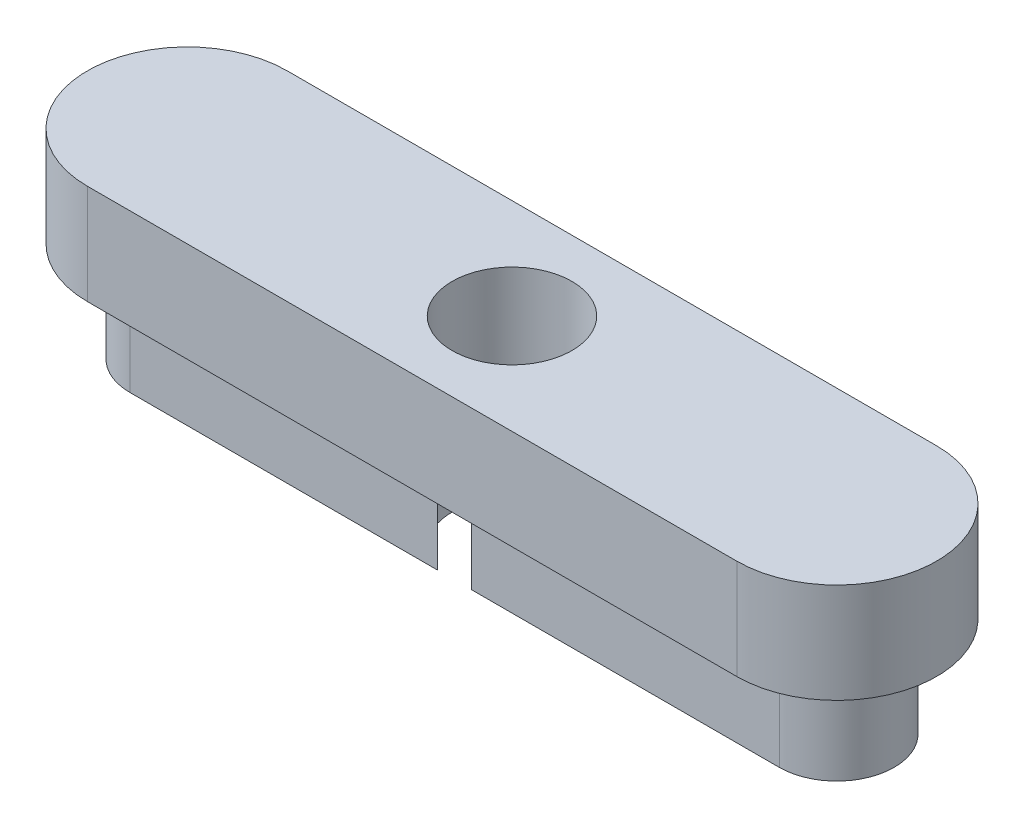
ISO-10303-21;
HEADER;
FILE_DESCRIPTION(('STEP AP214'),'2;1');
FILE_NAME('part.step','',(''),(''),'','','');
FILE_SCHEMA(('AUTOMOTIVE_DESIGN { 1 0 10303 214 1 1 1 1 }'));
ENDSEC;
DATA;
#1=APPLICATION_CONTEXT('core data for automotive mechanical design processes');
#2=APPLICATION_PROTOCOL_DEFINITION('international standard','automotive_design',2000,#1);
#3=PRODUCT_CONTEXT('',#1,'mechanical');
#4=PRODUCT('Part','Part','',(#3));
#5=PRODUCT_RELATED_PRODUCT_CATEGORY('part','',(#4));
#6=PRODUCT_DEFINITION_FORMATION('','',#4);
#7=PRODUCT_DEFINITION_CONTEXT('part definition',#1,'design');
#8=PRODUCT_DEFINITION('design','',#6,#7);
#9=PRODUCT_DEFINITION_SHAPE('','',#8);
#10=(LENGTH_UNIT() NAMED_UNIT(*) SI_UNIT(.MILLI.,.METRE.));
#11=(NAMED_UNIT(*) PLANE_ANGLE_UNIT() SI_UNIT($,.RADIAN.));
#12=(NAMED_UNIT(*) SI_UNIT($,.STERADIAN.) SOLID_ANGLE_UNIT());
#13=UNCERTAINTY_MEASURE_WITH_UNIT(LENGTH_MEASURE(1.E-05),#10,'distance_accuracy_value','');
#14=(GEOMETRIC_REPRESENTATION_CONTEXT(3) GLOBAL_UNCERTAINTY_ASSIGNED_CONTEXT((#13)) GLOBAL_UNIT_ASSIGNED_CONTEXT((#10,
#11,#12)) REPRESENTATION_CONTEXT('',''));
#15=CARTESIAN_POINT('',(0.,0.,0.));
#16=DIRECTION('',(0.,0.,1.));
#17=DIRECTION('',(1.,0.,0.));
#18=AXIS2_PLACEMENT_3D('',#15,#16,#17);
#19=CARTESIAN_POINT('',(-6.5,-2.,-1.15000000000001));
#20=DIRECTION('',(0.,0.,1.));
#21=DIRECTION('',(1.,0.,0.));
#22=AXIS2_PLACEMENT_3D('',#19,#20,#21);
#23=PLANE('',#22);
#24=DIRECTION('',(1.,0.,0.));
#25=VECTOR('',#24,1.);
#26=CARTESIAN_POINT('',(-6.5,0.,-1.15000000000001));
#27=LINE('',#26,#25);
#28=CARTESIAN_POINT('',(-6.5,0.,-1.15000000000001));
#29=VERTEX_POINT('',#28);
#30=CARTESIAN_POINT('',(-0.342782730020034,0.,-1.15000000000001));
#31=VERTEX_POINT('',#30);
#32=EDGE_CURVE('E183',#29,#31,#27,.T.);
#33=ORIENTED_EDGE('',*,*,#32,.T.);
#34=DIRECTION('',(0.,-1.,0.));
#35=VECTOR('',#34,1.);
#36=CARTESIAN_POINT('',(-0.342782730020034,2.,-1.15000000000001));
#37=LINE('',#36,#35);
#38=CARTESIAN_POINT('',(-0.342782730020034,-2.,-1.15000000000001));
#39=VERTEX_POINT('',#38);
#40=EDGE_CURVE('E182',#31,#39,#37,.T.);
#41=ORIENTED_EDGE('',*,*,#40,.T.);
#42=DIRECTION('',(1.,0.,0.));
#43=VECTOR('',#42,1.);
#44=CARTESIAN_POINT('',(-6.5,-2.,-1.15000000000001));
#45=LINE('',#44,#43);
#46=CARTESIAN_POINT('',(-6.5,-2.,-1.15000000000001));
#47=VERTEX_POINT('',#46);
#48=EDGE_CURVE('E159',#47,#39,#45,.T.);
#49=ORIENTED_EDGE('',*,*,#48,.F.);
#50=DIRECTION('',(0.,1.,0.));
#51=VECTOR('',#50,1.);
#52=CARTESIAN_POINT('',(-6.5,-2.,-1.15000000000001));
#53=LINE('',#52,#51);
#54=EDGE_CURVE('E203',#47,#29,#53,.T.);
#55=ORIENTED_EDGE('',*,*,#54,.T.);
#56=EDGE_LOOP('',(#33,#41,#49,#55));
#57=FACE_BOUND('',#56,.T.);
#58=ADVANCED_FACE('F43',(#57),#23,.F.);
#59=CARTESIAN_POINT('',(-6.5,-2.,1.15000000000001));
#60=DIRECTION('',(0.,0.,-1.));
#61=DIRECTION('',(-1.,0.,0.));
#62=AXIS2_PLACEMENT_3D('',#59,#60,#61);
#63=PLANE('',#62);
#64=DIRECTION('',(-1.,0.,0.));
#65=VECTOR('',#64,1.);
#66=CARTESIAN_POINT('',(-6.5,0.,1.15000000000001));
#67=LINE('',#66,#65);
#68=CARTESIAN_POINT('',(6.5,0.,1.15000000000001));
#69=VERTEX_POINT('',#68);
#70=CARTESIAN_POINT('',(0.342782730020026,0.,1.15000000000001));
#71=VERTEX_POINT('',#70);
#72=EDGE_CURVE('E167',#69,#71,#67,.T.);
#73=ORIENTED_EDGE('',*,*,#72,.T.);
#74=DIRECTION('',(0.,-1.,0.));
#75=VECTOR('',#74,1.);
#76=CARTESIAN_POINT('',(0.342782730020025,2.,1.15000000000001));
#77=LINE('',#76,#75);
#78=CARTESIAN_POINT('',(0.342782730020026,-2.,1.15000000000001));
#79=VERTEX_POINT('',#78);
#80=EDGE_CURVE('E142',#71,#79,#77,.T.);
#81=ORIENTED_EDGE('',*,*,#80,.T.);
#82=DIRECTION('',(-1.,0.,0.));
#83=VECTOR('',#82,1.);
#84=CARTESIAN_POINT('',(-6.5,-2.,1.15000000000001));
#85=LINE('',#84,#83);
#86=CARTESIAN_POINT('',(6.5,-2.,1.15000000000001));
#87=VERTEX_POINT('',#86);
#88=EDGE_CURVE('E150',#87,#79,#85,.T.);
#89=ORIENTED_EDGE('',*,*,#88,.F.);
#90=DIRECTION('',(0.,1.,0.));
#91=VECTOR('',#90,1.);
#92=CARTESIAN_POINT('',(6.5,-2.,1.15000000000001));
#93=LINE('',#92,#91);
#94=EDGE_CURVE('E197',#87,#69,#93,.T.);
#95=ORIENTED_EDGE('',*,*,#94,.T.);
#96=EDGE_LOOP('',(#73,#81,#89,#95));
#97=FACE_BOUND('',#96,.T.);
#98=ADVANCED_FACE('F284',(#97),#63,.F.);
#99=CARTESIAN_POINT('',(-6.5,-2.,0.));
#100=DIRECTION('',(0.,-1.,0.));
#101=DIRECTION('',(0.,0.,-1.));
#102=AXIS2_PLACEMENT_3D('',#99,#100,#101);
#103=PLANE('',#102);
#104=CARTESIAN_POINT('',(0.,-2.,0.));
#105=DIRECTION('',(0.,-1.,0.));
#106=DIRECTION('',(0.,0.,-1.));
#107=AXIS2_PLACEMENT_3D('',#104,#105,#106);
#108=CIRCLE('',#107,1.2);
#109=CARTESIAN_POINT('',(0.342782730020034,-2.,-1.15000000000001));
#110=VERTEX_POINT('',#109);
#111=EDGE_CURVE('E134',#110,#79,#108,.T.);
#112=ORIENTED_EDGE('',*,*,#111,.F.);
#113=CARTESIAN_POINT('',(6.5,-2.,-1.15));
#114=VERTEX_POINT('',#113);
#115=EDGE_CURVE('E147',#110,#114,#45,.T.);
#116=ORIENTED_EDGE('',*,*,#115,.T.);
#117=CARTESIAN_POINT('',(6.5,-2.,0.));
#118=DIRECTION('',(0.,-1.,0.));
#119=DIRECTION('',(0.,0.,-1.));
#120=AXIS2_PLACEMENT_3D('',#117,#118,#119);
#121=CIRCLE('',#120,1.15000000000001);
#122=EDGE_CURVE('E165',#114,#87,#121,.T.);
#123=ORIENTED_EDGE('',*,*,#122,.T.);
#124=ORIENTED_EDGE('',*,*,#88,.T.);
#125=EDGE_LOOP('',(#112,#116,#123,#124));
#126=FACE_BOUND('',#125,.T.);
#127=ADVANCED_FACE('F146',(#126),#103,.T.);
#128=CARTESIAN_POINT('',(-6.5,0.,0.));
#129=DIRECTION('',(0.,1.,0.));
#130=DIRECTION('',(0.,0.,1.));
#131=AXIS2_PLACEMENT_3D('',#128,#129,#130);
#132=PLANE('',#131);
#133=CARTESIAN_POINT('',(-6.5,0.,0.));
#134=DIRECTION('',(0.,1.,0.));
#135=DIRECTION('',(0.,0.,1.));
#136=AXIS2_PLACEMENT_3D('',#133,#134,#135);
#137=CIRCLE('',#136,2.);
#138=CARTESIAN_POINT('',(-6.5,0.,-2.));
#139=VERTEX_POINT('',#138);
#140=CARTESIAN_POINT('',(-6.5,0.,2.));
#141=VERTEX_POINT('',#140);
#142=EDGE_CURVE('E207',#139,#141,#137,.T.);
#143=ORIENTED_EDGE('',*,*,#142,.F.);
#144=DIRECTION('',(-1.,0.,0.));
#145=VECTOR('',#144,1.);
#146=CARTESIAN_POINT('',(-6.5,0.,-2.));
#147=LINE('',#146,#145);
#148=CARTESIAN_POINT('',(6.5,0.,-2.));
#149=VERTEX_POINT('',#148);
#150=EDGE_CURVE('E213',#149,#139,#147,.T.);
#151=ORIENTED_EDGE('',*,*,#150,.F.);
#152=CARTESIAN_POINT('',(6.5,0.,0.));
#153=DIRECTION('',(0.,1.,0.));
#154=DIRECTION('',(0.,0.,1.));
#155=AXIS2_PLACEMENT_3D('',#152,#153,#154);
#156=CIRCLE('',#155,2.);
#157=CARTESIAN_POINT('',(6.5,0.,2.));
#158=VERTEX_POINT('',#157);
#159=EDGE_CURVE('E229',#158,#149,#156,.T.);
#160=ORIENTED_EDGE('',*,*,#159,.F.);
#161=DIRECTION('',(1.,0.,0.));
#162=VECTOR('',#161,1.);
#163=CARTESIAN_POINT('',(-6.5,0.,2.));
#164=LINE('',#163,#162);
#165=EDGE_CURVE('E226',#141,#158,#164,.T.);
#166=ORIENTED_EDGE('',*,*,#165,.F.);
#167=EDGE_LOOP('',(#143,#151,#160,#166));
#168=FACE_BOUND('',#167,.T.);
#169=CARTESIAN_POINT('',(0.342782730020034,0.,-1.15000000000001));
#170=VERTEX_POINT('',#169);
#171=CARTESIAN_POINT('',(6.5,0.,-1.15));
#172=VERTEX_POINT('',#171);
#173=EDGE_CURVE('E181',#170,#172,#27,.T.);
#174=ORIENTED_EDGE('',*,*,#173,.F.);
#175=CARTESIAN_POINT('',(0.,0.,0.));
#176=DIRECTION('',(0.,1.,0.));
#177=DIRECTION('',(0.,0.,1.));
#178=AXIS2_PLACEMENT_3D('',#175,#176,#177);
#179=CIRCLE('',#178,1.2);
#180=EDGE_CURVE('E137',#170,#31,#179,.T.);
#181=ORIENTED_EDGE('',*,*,#180,.T.);
#182=ORIENTED_EDGE('',*,*,#32,.F.);
#183=CARTESIAN_POINT('',(-6.5,0.,0.));
#184=DIRECTION('',(0.,-1.,0.));
#185=DIRECTION('',(0.,0.,-1.));
#186=AXIS2_PLACEMENT_3D('',#183,#184,#185);
#187=CIRCLE('',#186,1.15000000000001);
#188=CARTESIAN_POINT('',(-6.5,0.,1.15000000000001));
#189=VERTEX_POINT('',#188);
#190=EDGE_CURVE('E177',#189,#29,#187,.T.);
#191=ORIENTED_EDGE('',*,*,#190,.F.);
#192=CARTESIAN_POINT('',(-0.342782730020025,0.,1.15000000000001));
#193=VERTEX_POINT('',#192);
#194=EDGE_CURVE('E65',#193,#189,#67,.T.);
#195=ORIENTED_EDGE('',*,*,#194,.F.);
#196=EDGE_CURVE('E316',#193,#71,#179,.T.);
#197=ORIENTED_EDGE('',*,*,#196,.T.);
#198=ORIENTED_EDGE('',*,*,#72,.F.);
#199=CARTESIAN_POINT('',(6.5,0.,0.));
#200=DIRECTION('',(0.,-1.,0.));
#201=DIRECTION('',(0.,0.,-1.));
#202=AXIS2_PLACEMENT_3D('',#199,#200,#201);
#203=CIRCLE('',#202,1.15000000000001);
#204=EDGE_CURVE('E187',#172,#69,#203,.T.);
#205=ORIENTED_EDGE('',*,*,#204,.F.);
#206=EDGE_LOOP('',(#174,#181,#182,#191,#195,#197,#198,#205));
#207=FACE_BOUND('',#206,.T.);
#208=ADVANCED_FACE('F256',(#168,#207),#132,.F.);
#209=CARTESIAN_POINT('',(-6.5,2.,0.));
#210=DIRECTION('',(0.,-1.,0.));
#211=DIRECTION('',(0.,0.,-1.));
#212=AXIS2_PLACEMENT_3D('',#209,#210,#211);
#213=CYLINDRICAL_SURFACE('',#212,2.);
#214=ORIENTED_EDGE('',*,*,#142,.T.);
#215=DIRECTION('',(0.,-1.,0.));
#216=VECTOR('',#215,1.);
#217=CARTESIAN_POINT('',(-6.5,2.,2.));
#218=LINE('',#217,#216);
#219=CARTESIAN_POINT('',(-6.5,2.,2.));
#220=VERTEX_POINT('',#219);
#221=EDGE_CURVE('E52',#220,#141,#218,.T.);
#222=ORIENTED_EDGE('',*,*,#221,.F.);
#223=CARTESIAN_POINT('',(-6.5,2.,0.));
#224=DIRECTION('',(0.,1.,0.));
#225=DIRECTION('',(0.,0.,1.));
#226=AXIS2_PLACEMENT_3D('',#223,#224,#225);
#227=CIRCLE('',#226,2.);
#228=CARTESIAN_POINT('',(-6.5,2.,-2.));
#229=VERTEX_POINT('',#228);
#230=EDGE_CURVE('E208',#229,#220,#227,.T.);
#231=ORIENTED_EDGE('',*,*,#230,.F.);
#232=DIRECTION('',(0.,-1.,0.));
#233=VECTOR('',#232,1.);
#234=CARTESIAN_POINT('',(-6.5,2.,-2.));
#235=LINE('',#234,#233);
#236=EDGE_CURVE('E222',#229,#139,#235,.T.);
#237=ORIENTED_EDGE('',*,*,#236,.T.);
#238=EDGE_LOOP('',(#214,#222,#231,#237));
#239=FACE_BOUND('',#238,.T.);
#240=ADVANCED_FACE('F45',(#239),#213,.T.);
#241=CARTESIAN_POINT('',(-6.5,2.,2.));
#242=DIRECTION('',(0.,0.,-1.));
#243=DIRECTION('',(-1.,0.,0.));
#244=AXIS2_PLACEMENT_3D('',#241,#242,#243);
#245=PLANE('',#244);
#246=ORIENTED_EDGE('',*,*,#165,.T.);
#247=DIRECTION('',(0.,-1.,0.));
#248=VECTOR('',#247,1.);
#249=CARTESIAN_POINT('',(6.5,2.,2.));
#250=LINE('',#249,#248);
#251=CARTESIAN_POINT('',(6.5,2.,2.));
#252=VERTEX_POINT('',#251);
#253=EDGE_CURVE('E241',#252,#158,#250,.T.);
#254=ORIENTED_EDGE('',*,*,#253,.F.);
#255=DIRECTION('',(1.,0.,0.));
#256=VECTOR('',#255,1.);
#257=CARTESIAN_POINT('',(-6.5,2.,2.));
#258=LINE('',#257,#256);
#259=EDGE_CURVE('E212',#220,#252,#258,.T.);
#260=ORIENTED_EDGE('',*,*,#259,.F.);
#261=ORIENTED_EDGE('',*,*,#221,.T.);
#262=EDGE_LOOP('',(#246,#254,#260,#261));
#263=FACE_BOUND('',#262,.T.);
#264=ADVANCED_FACE('F248',(#263),#245,.F.);
#265=CARTESIAN_POINT('',(6.5,2.,0.));
#266=DIRECTION('',(0.,-1.,0.));
#267=DIRECTION('',(0.,0.,-1.));
#268=AXIS2_PLACEMENT_3D('',#265,#266,#267);
#269=CYLINDRICAL_SURFACE('',#268,2.);
#270=ORIENTED_EDGE('',*,*,#159,.T.);
#271=DIRECTION('',(0.,-1.,0.));
#272=VECTOR('',#271,1.);
#273=CARTESIAN_POINT('',(6.5,2.,-2.));
#274=LINE('',#273,#272);
#275=CARTESIAN_POINT('',(6.5,2.,-2.));
#276=VERTEX_POINT('',#275);
#277=EDGE_CURVE('E237',#276,#149,#274,.T.);
#278=ORIENTED_EDGE('',*,*,#277,.F.);
#279=CARTESIAN_POINT('',(6.5,2.,0.));
#280=DIRECTION('',(0.,1.,0.));
#281=DIRECTION('',(0.,0.,1.));
#282=AXIS2_PLACEMENT_3D('',#279,#280,#281);
#283=CIRCLE('',#282,2.);
#284=EDGE_CURVE('E216',#252,#276,#283,.T.);
#285=ORIENTED_EDGE('',*,*,#284,.F.);
#286=ORIENTED_EDGE('',*,*,#253,.T.);
#287=EDGE_LOOP('',(#270,#278,#285,#286));
#288=FACE_BOUND('',#287,.T.);
#289=ADVANCED_FACE('F261',(#288),#269,.T.);
#290=CARTESIAN_POINT('',(-6.5,2.,-2.));
#291=DIRECTION('',(0.,0.,1.));
#292=DIRECTION('',(1.,0.,0.));
#293=AXIS2_PLACEMENT_3D('',#290,#291,#292);
#294=PLANE('',#293);
#295=ORIENTED_EDGE('',*,*,#150,.T.);
#296=ORIENTED_EDGE('',*,*,#236,.F.);
#297=DIRECTION('',(-1.,0.,0.));
#298=VECTOR('',#297,1.);
#299=CARTESIAN_POINT('',(-6.5,2.,-2.));
#300=LINE('',#299,#298);
#301=EDGE_CURVE('E219',#276,#229,#300,.T.);
#302=ORIENTED_EDGE('',*,*,#301,.F.);
#303=ORIENTED_EDGE('',*,*,#277,.T.);
#304=EDGE_LOOP('',(#295,#296,#302,#303));
#305=FACE_BOUND('',#304,.T.);
#306=ADVANCED_FACE('F265',(#305),#294,.F.);
#307=CARTESIAN_POINT('',(-6.5,2.,0.));
#308=DIRECTION('',(0.,1.,0.));
#309=DIRECTION('',(0.,0.,1.));
#310=AXIS2_PLACEMENT_3D('',#307,#308,#309);
#311=PLANE('',#310);
#312=CARTESIAN_POINT('',(0.,2.,0.));
#313=DIRECTION('',(0.,-1.,0.));
#314=DIRECTION('',(0.,0.,-1.));
#315=AXIS2_PLACEMENT_3D('',#312,#313,#314);
#316=CIRCLE('',#315,1.2);
#317=CARTESIAN_POINT('',(0.,2.,-1.2));
#318=VERTEX_POINT('',#317);
#319=EDGE_CURVE('E152',#318,#318,#316,.T.);
#320=ORIENTED_EDGE('',*,*,#319,.T.);
#321=EDGE_LOOP('',(#320));
#322=FACE_BOUND('',#321,.T.);
#323=ORIENTED_EDGE('',*,*,#230,.T.);
#324=ORIENTED_EDGE('',*,*,#259,.T.);
#325=ORIENTED_EDGE('',*,*,#284,.T.);
#326=ORIENTED_EDGE('',*,*,#301,.T.);
#327=EDGE_LOOP('',(#323,#324,#325,#326));
#328=FACE_BOUND('',#327,.T.);
#329=ADVANCED_FACE('F267',(#322,#328),#311,.T.);
#330=CARTESIAN_POINT('',(-6.5,-2.,0.));
#331=DIRECTION('',(0.,1.,0.));
#332=DIRECTION('',(0.,0.,1.));
#333=AXIS2_PLACEMENT_3D('',#330,#331,#332);
#334=CYLINDRICAL_SURFACE('',#333,1.15000000000001);
#335=ORIENTED_EDGE('',*,*,#190,.T.);
#336=ORIENTED_EDGE('',*,*,#54,.F.);
#337=CARTESIAN_POINT('',(-6.5,-2.,0.));
#338=DIRECTION('',(0.,-1.,0.));
#339=DIRECTION('',(0.,0.,-1.));
#340=AXIS2_PLACEMENT_3D('',#337,#338,#339);
#341=CIRCLE('',#340,1.15000000000001);
#342=CARTESIAN_POINT('',(-6.5,-2.,1.15000000000001));
#343=VERTEX_POINT('',#342);
#344=EDGE_CURVE('E160',#343,#47,#341,.T.);
#345=ORIENTED_EDGE('',*,*,#344,.F.);
#346=DIRECTION('',(0.,1.,0.));
#347=VECTOR('',#346,1.);
#348=CARTESIAN_POINT('',(-6.5,-2.,1.15000000000001));
#349=LINE('',#348,#347);
#350=EDGE_CURVE('E176',#343,#189,#349,.T.);
#351=ORIENTED_EDGE('',*,*,#350,.T.);
#352=EDGE_LOOP('',(#335,#336,#345,#351));
#353=FACE_BOUND('',#352,.T.);
#354=ADVANCED_FACE('F269',(#353),#334,.T.);
#355=ORIENTED_EDGE('',*,*,#115,.F.);
#356=DIRECTION('',(0.,-1.,0.));
#357=VECTOR('',#356,1.);
#358=CARTESIAN_POINT('',(0.342782730020034,2.,-1.15000000000001));
#359=LINE('',#358,#357);
#360=EDGE_CURVE('E131',#110,#170,#359,.F.);
#361=ORIENTED_EDGE('',*,*,#360,.T.);
#362=ORIENTED_EDGE('',*,*,#173,.T.);
#363=DIRECTION('',(0.,1.,0.));
#364=VECTOR('',#363,1.);
#365=CARTESIAN_POINT('',(6.5,-2.,-1.15));
#366=LINE('',#365,#364);
#367=EDGE_CURVE('E156',#114,#172,#366,.T.);
#368=ORIENTED_EDGE('',*,*,#367,.F.);
#369=EDGE_LOOP('',(#355,#361,#362,#368));
#370=FACE_BOUND('',#369,.T.);
#371=ADVANCED_FACE('F154',(#370),#23,.F.);
#372=CARTESIAN_POINT('',(6.5,-2.,0.));
#373=DIRECTION('',(0.,1.,0.));
#374=DIRECTION('',(0.,0.,1.));
#375=AXIS2_PLACEMENT_3D('',#372,#373,#374);
#376=CYLINDRICAL_SURFACE('',#375,1.15000000000001);
#377=ORIENTED_EDGE('',*,*,#204,.T.);
#378=ORIENTED_EDGE('',*,*,#94,.F.);
#379=ORIENTED_EDGE('',*,*,#122,.F.);
#380=ORIENTED_EDGE('',*,*,#367,.T.);
#381=EDGE_LOOP('',(#377,#378,#379,#380));
#382=FACE_BOUND('',#381,.T.);
#383=ADVANCED_FACE('F296',(#382),#376,.T.);
#384=CARTESIAN_POINT('',(-0.342782730020027,-2.,1.15000000000001));
#385=VERTEX_POINT('',#384);
#386=EDGE_CURVE('E173',#385,#343,#85,.T.);
#387=ORIENTED_EDGE('',*,*,#386,.F.);
#388=DIRECTION('',(0.,-1.,0.));
#389=VECTOR('',#388,1.);
#390=CARTESIAN_POINT('',(-0.342782730020025,2.,1.15000000000001));
#391=LINE('',#390,#389);
#392=EDGE_CURVE('E58',#385,#193,#391,.F.);
#393=ORIENTED_EDGE('',*,*,#392,.T.);
#394=ORIENTED_EDGE('',*,*,#194,.T.);
#395=ORIENTED_EDGE('',*,*,#350,.F.);
#396=EDGE_LOOP('',(#387,#393,#394,#395));
#397=FACE_BOUND('',#396,.T.);
#398=ADVANCED_FACE('F293',(#397),#63,.F.);
#399=CARTESIAN_POINT('',(0.,-2.,0.));
#400=DIRECTION('',(0.,-1.,0.));
#401=DIRECTION('',(0.,0.,-1.));
#402=AXIS2_PLACEMENT_3D('',#399,#400,#401);
#403=CIRCLE('',#402,1.2);
#404=EDGE_CURVE('E11',#385,#39,#403,.T.);
#405=ORIENTED_EDGE('',*,*,#404,.F.);
#406=ORIENTED_EDGE('',*,*,#386,.T.);
#407=ORIENTED_EDGE('',*,*,#344,.T.);
#408=ORIENTED_EDGE('',*,*,#48,.T.);
#409=EDGE_LOOP('',(#405,#406,#407,#408));
#410=FACE_BOUND('',#409,.T.);
#411=ADVANCED_FACE('F303',(#410),#103,.T.);
#412=CARTESIAN_POINT('',(0.,2.,0.));
#413=DIRECTION('',(0.,-1.,0.));
#414=DIRECTION('',(0.,0.,-1.));
#415=AXIS2_PLACEMENT_3D('',#412,#413,#414);
#416=CYLINDRICAL_SURFACE('',#415,1.2);
#417=ORIENTED_EDGE('',*,*,#319,.F.);
#418=EDGE_LOOP('',(#417));
#419=FACE_BOUND('',#418,.T.);
#420=ORIENTED_EDGE('',*,*,#180,.F.);
#421=ORIENTED_EDGE('',*,*,#360,.F.);
#422=ORIENTED_EDGE('',*,*,#111,.T.);
#423=ORIENTED_EDGE('',*,*,#80,.F.);
#424=ORIENTED_EDGE('',*,*,#196,.F.);
#425=ORIENTED_EDGE('',*,*,#392,.F.);
#426=ORIENTED_EDGE('',*,*,#404,.T.);
#427=ORIENTED_EDGE('',*,*,#40,.F.);
#428=EDGE_LOOP('',(#420,#421,#422,#423,#424,#425,#426,#427));
#429=FACE_BOUND('',#428,.T.);
#430=ADVANCED_FACE('F133',(#419,#429),#416,.F.);
#431=CLOSED_SHELL('',(#58,#98,#127,#208,#240,#264,#289,#306,#329,#354,#371,#383,#398,#411,#430));
#432=MANIFOLD_SOLID_BREP('B2',#431);
#433=ADVANCED_BREP_SHAPE_REPRESENTATION('',(#18,#432),#14);
#434=SHAPE_DEFINITION_REPRESENTATION(#9,#433);
ENDSEC;
END-ISO-10303-21;
